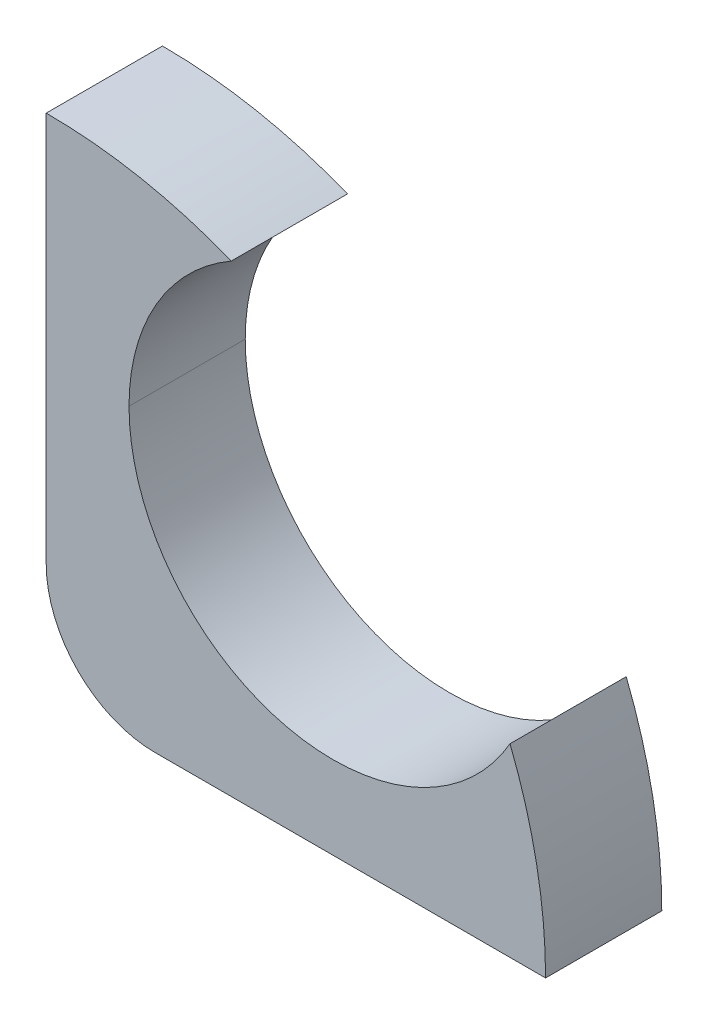
ISO-10303-21;
HEADER;
FILE_DESCRIPTION(('STEP AP214'),'2;1');
FILE_NAME('part.step','',(''),(''),'','','');
FILE_SCHEMA(('AUTOMOTIVE_DESIGN { 1 0 10303 214 1 1 1 1 }'));
ENDSEC;
DATA;
#1=APPLICATION_CONTEXT('core data for automotive mechanical design processes');
#2=APPLICATION_PROTOCOL_DEFINITION('international standard','automotive_design',2000,#1);
#3=PRODUCT_CONTEXT('',#1,'mechanical');
#4=PRODUCT('Part','Part','',(#3));
#5=PRODUCT_RELATED_PRODUCT_CATEGORY('part','',(#4));
#6=PRODUCT_DEFINITION_FORMATION('','',#4);
#7=PRODUCT_DEFINITION_CONTEXT('part definition',#1,'design');
#8=PRODUCT_DEFINITION('design','',#6,#7);
#9=PRODUCT_DEFINITION_SHAPE('','',#8);
#10=(LENGTH_UNIT() NAMED_UNIT(*) SI_UNIT(.MILLI.,.METRE.));
#11=(NAMED_UNIT(*) PLANE_ANGLE_UNIT() SI_UNIT($,.RADIAN.));
#12=(NAMED_UNIT(*) SI_UNIT($,.STERADIAN.) SOLID_ANGLE_UNIT());
#13=UNCERTAINTY_MEASURE_WITH_UNIT(LENGTH_MEASURE(1.E-05),#10,'distance_accuracy_value','');
#14=(GEOMETRIC_REPRESENTATION_CONTEXT(3) GLOBAL_UNCERTAINTY_ASSIGNED_CONTEXT((#13)) GLOBAL_UNIT_ASSIGNED_CONTEXT((#10,
#11,#12)) REPRESENTATION_CONTEXT('',''));
#15=CARTESIAN_POINT('',(0.,0.,0.));
#16=DIRECTION('',(0.,0.,1.));
#17=DIRECTION('',(1.,0.,0.));
#18=AXIS2_PLACEMENT_3D('',#15,#16,#17);
#19=CARTESIAN_POINT('',(-18.45,-18.45,18.95));
#20=DIRECTION('',(0.,0.,1.));
#21=DIRECTION('',(1.,0.,0.));
#22=AXIS2_PLACEMENT_3D('',#19,#20,#21);
#23=PLANE('',#22);
#24=CARTESIAN_POINT('',(-18.45,-18.45,18.95));
#25=DIRECTION('',(0.,0.,1.));
#26=DIRECTION('',(1.,0.,0.));
#27=AXIS2_PLACEMENT_3D('',#24,#25,#26);
#28=CIRCLE('',#27,1.5);
#29=CARTESIAN_POINT('',(-19.95,-18.45,18.95));
#30=VERTEX_POINT('',#29);
#31=CARTESIAN_POINT('',(-18.45,-19.95,18.95));
#32=VERTEX_POINT('',#31);
#33=EDGE_CURVE('E109',#30,#32,#28,.T.);
#34=ORIENTED_EDGE('',*,*,#33,.F.);
#35=DIRECTION('',(0.,-1.,0.));
#36=VECTOR('',#35,1.);
#37=CARTESIAN_POINT('',(-19.95,-13.075,18.95));
#38=LINE('',#37,#36);
#39=CARTESIAN_POINT('',(-19.95,-13.075,18.95));
#40=VERTEX_POINT('',#39);
#41=EDGE_CURVE('E26',#40,#30,#38,.T.);
#42=ORIENTED_EDGE('',*,*,#41,.F.);
#43=CARTESIAN_POINT('',(-19.95,-19.95,18.95));
#44=DIRECTION('',(0.,0.,1.));
#45=DIRECTION('',(1.,0.,0.));
#46=AXIS2_PLACEMENT_3D('',#43,#44,#45);
#47=CIRCLE('',#46,6.875);
#48=CARTESIAN_POINT('',(-17.4018583423997,-13.5646574803851,18.95));
#49=VERTEX_POINT('',#48);
#50=EDGE_CURVE('E147',#49,#40,#47,.T.);
#51=ORIENTED_EDGE('',*,*,#50,.F.);
#52=CARTESIAN_POINT('',(-16.,-16.,18.95));
#53=DIRECTION('',(0.,0.,-1.));
#54=DIRECTION('',(1.,0.,0.));
#55=AXIS2_PLACEMENT_3D('',#52,#53,#54);
#56=CIRCLE('',#55,2.81);
#57=CARTESIAN_POINT('',(-18.81,-16.,18.95));
#58=VERTEX_POINT('',#57);
#59=EDGE_CURVE('E133',#58,#49,#56,.T.);
#60=ORIENTED_EDGE('',*,*,#59,.F.);
#61=CARTESIAN_POINT('',(-16.,-16.,18.95));
#62=DIRECTION('',(0.,0.,-1.));
#63=DIRECTION('',(1.,0.,0.));
#64=AXIS2_PLACEMENT_3D('',#61,#62,#63);
#65=CIRCLE('',#64,2.81);
#66=CARTESIAN_POINT('',(-13.5646574803851,-17.4018583423997,18.95));
#67=VERTEX_POINT('',#66);
#68=EDGE_CURVE('E144',#67,#58,#65,.T.);
#69=ORIENTED_EDGE('',*,*,#68,.F.);
#70=CARTESIAN_POINT('',(-19.95,-19.95,18.95));
#71=DIRECTION('',(0.,0.,1.));
#72=DIRECTION('',(1.,0.,0.));
#73=AXIS2_PLACEMENT_3D('',#70,#71,#72);
#74=CIRCLE('',#73,6.875);
#75=CARTESIAN_POINT('',(-13.075,-19.95,18.95));
#76=VERTEX_POINT('',#75);
#77=EDGE_CURVE('E97',#76,#67,#74,.T.);
#78=ORIENTED_EDGE('',*,*,#77,.F.);
#79=DIRECTION('',(1.,0.,0.));
#80=VECTOR('',#79,1.);
#81=CARTESIAN_POINT('',(-18.45,-19.95,18.95));
#82=LINE('',#81,#80);
#83=EDGE_CURVE('E124',#32,#76,#82,.T.);
#84=ORIENTED_EDGE('',*,*,#83,.F.);
#85=EDGE_LOOP('',(#34,#42,#51,#60,#69,#78,#84));
#86=FACE_BOUND('',#85,.T.);
#87=ADVANCED_FACE('F16',(#86),#23,.F.);
#88=CARTESIAN_POINT('',(-18.45,-18.45,20.55));
#89=DIRECTION('',(0.,0.,1.));
#90=DIRECTION('',(1.,0.,0.));
#91=AXIS2_PLACEMENT_3D('',#88,#89,#90);
#92=PLANE('',#91);
#93=CARTESIAN_POINT('',(-18.45,-18.45,20.55));
#94=DIRECTION('',(0.,0.,1.));
#95=DIRECTION('',(1.,0.,0.));
#96=AXIS2_PLACEMENT_3D('',#93,#94,#95);
#97=CIRCLE('',#96,1.5);
#98=CARTESIAN_POINT('',(-19.95,-18.45,20.55));
#99=VERTEX_POINT('',#98);
#100=CARTESIAN_POINT('',(-18.45,-19.95,20.55));
#101=VERTEX_POINT('',#100);
#102=EDGE_CURVE('E100',#99,#101,#97,.T.);
#103=ORIENTED_EDGE('',*,*,#102,.T.);
#104=DIRECTION('',(1.,0.,0.));
#105=VECTOR('',#104,1.);
#106=CARTESIAN_POINT('',(-18.45,-19.95,20.55));
#107=LINE('',#106,#105);
#108=CARTESIAN_POINT('',(-13.075,-19.95,20.55));
#109=VERTEX_POINT('',#108);
#110=EDGE_CURVE('E85',#101,#109,#107,.T.);
#111=ORIENTED_EDGE('',*,*,#110,.T.);
#112=CARTESIAN_POINT('',(-19.95,-19.95,20.55));
#113=DIRECTION('',(0.,0.,1.));
#114=DIRECTION('',(1.,0.,0.));
#115=AXIS2_PLACEMENT_3D('',#112,#113,#114);
#116=CIRCLE('',#115,6.875);
#117=CARTESIAN_POINT('',(-13.5646574803851,-17.4018583423997,20.55));
#118=VERTEX_POINT('',#117);
#119=EDGE_CURVE('E132',#109,#118,#116,.T.);
#120=ORIENTED_EDGE('',*,*,#119,.T.);
#121=CARTESIAN_POINT('',(-16.,-16.,20.55));
#122=DIRECTION('',(0.,0.,-1.));
#123=DIRECTION('',(1.,0.,0.));
#124=AXIS2_PLACEMENT_3D('',#121,#122,#123);
#125=CIRCLE('',#124,2.81);
#126=CARTESIAN_POINT('',(-18.81,-16.,20.55));
#127=VERTEX_POINT('',#126);
#128=EDGE_CURVE('E140',#118,#127,#125,.T.);
#129=ORIENTED_EDGE('',*,*,#128,.T.);
#130=CARTESIAN_POINT('',(-16.,-16.,20.55));
#131=DIRECTION('',(0.,0.,-1.));
#132=DIRECTION('',(1.,0.,0.));
#133=AXIS2_PLACEMENT_3D('',#130,#131,#132);
#134=CIRCLE('',#133,2.81);
#135=CARTESIAN_POINT('',(-17.4018583423997,-13.5646574803851,20.55));
#136=VERTEX_POINT('',#135);
#137=EDGE_CURVE('E118',#127,#136,#134,.T.);
#138=ORIENTED_EDGE('',*,*,#137,.T.);
#139=CARTESIAN_POINT('',(-19.95,-19.95,20.55));
#140=DIRECTION('',(0.,0.,1.));
#141=DIRECTION('',(1.,0.,0.));
#142=AXIS2_PLACEMENT_3D('',#139,#140,#141);
#143=CIRCLE('',#142,6.875);
#144=CARTESIAN_POINT('',(-19.95,-13.075,20.55));
#145=VERTEX_POINT('',#144);
#146=EDGE_CURVE('E154',#136,#145,#143,.T.);
#147=ORIENTED_EDGE('',*,*,#146,.T.);
#148=DIRECTION('',(0.,-1.,0.));
#149=VECTOR('',#148,1.);
#150=CARTESIAN_POINT('',(-19.95,-13.075,20.55));
#151=LINE('',#150,#149);
#152=EDGE_CURVE('E11',#145,#99,#151,.T.);
#153=ORIENTED_EDGE('',*,*,#152,.T.);
#154=EDGE_LOOP('',(#103,#111,#120,#129,#138,#147,#153));
#155=FACE_BOUND('',#154,.T.);
#156=ADVANCED_FACE('F101',(#155),#92,.T.);
#157=CARTESIAN_POINT('',(-19.95,-13.075,20.55));
#158=DIRECTION('',(1.,0.,0.));
#159=DIRECTION('',(0.,1.,0.));
#160=AXIS2_PLACEMENT_3D('',#157,#158,#159);
#161=PLANE('',#160);
#162=ORIENTED_EDGE('',*,*,#41,.T.);
#163=DIRECTION('',(0.,0.,-1.));
#164=VECTOR('',#163,1.);
#165=CARTESIAN_POINT('',(-19.95,-18.45,20.55));
#166=LINE('',#165,#164);
#167=EDGE_CURVE('E105',#99,#30,#166,.T.);
#168=ORIENTED_EDGE('',*,*,#167,.F.);
#169=ORIENTED_EDGE('',*,*,#152,.F.);
#170=DIRECTION('',(0.,0.,-1.));
#171=VECTOR('',#170,1.);
#172=CARTESIAN_POINT('',(-19.95,-13.075,20.55));
#173=LINE('',#172,#171);
#174=EDGE_CURVE('E151',#145,#40,#173,.T.);
#175=ORIENTED_EDGE('',*,*,#174,.T.);
#176=EDGE_LOOP('',(#162,#168,#169,#175));
#177=FACE_BOUND('',#176,.T.);
#178=ADVANCED_FACE('F174',(#177),#161,.F.);
#179=CARTESIAN_POINT('',(-19.95,-19.95,20.55));
#180=DIRECTION('',(0.,0.,-1.));
#181=DIRECTION('',(-1.,0.,0.));
#182=AXIS2_PLACEMENT_3D('',#179,#180,#181);
#183=CYLINDRICAL_SURFACE('',#182,6.875);
#184=ORIENTED_EDGE('',*,*,#50,.T.);
#185=ORIENTED_EDGE('',*,*,#174,.F.);
#186=ORIENTED_EDGE('',*,*,#146,.F.);
#187=DIRECTION('',(0.,0.,-1.));
#188=VECTOR('',#187,1.);
#189=CARTESIAN_POINT('',(-17.4018583423997,-13.5646574803851,20.55));
#190=LINE('',#189,#188);
#191=EDGE_CURVE('E19',#136,#49,#190,.T.);
#192=ORIENTED_EDGE('',*,*,#191,.T.);
#193=EDGE_LOOP('',(#184,#185,#186,#192));
#194=FACE_BOUND('',#193,.T.);
#195=ADVANCED_FACE('F170',(#194),#183,.T.);
#196=CARTESIAN_POINT('',(-16.,-16.,20.55));
#197=DIRECTION('',(0.,0.,-1.));
#198=DIRECTION('',(-1.,0.,0.));
#199=AXIS2_PLACEMENT_3D('',#196,#197,#198);
#200=CYLINDRICAL_SURFACE('',#199,2.81);
#201=DIRECTION('',(0.,0.,-1.));
#202=VECTOR('',#201,1.);
#203=CARTESIAN_POINT('',(-18.81,-16.,20.55));
#204=LINE('',#203,#202);
#205=EDGE_CURVE('E121',#127,#58,#204,.T.);
#206=ORIENTED_EDGE('',*,*,#205,.F.);
#207=ORIENTED_EDGE('',*,*,#128,.F.);
#208=DIRECTION('',(0.,0.,-1.));
#209=VECTOR('',#208,1.);
#210=CARTESIAN_POINT('',(-13.5646574803851,-17.4018583423997,20.55));
#211=LINE('',#210,#209);
#212=EDGE_CURVE('E128',#118,#67,#211,.T.);
#213=ORIENTED_EDGE('',*,*,#212,.T.);
#214=ORIENTED_EDGE('',*,*,#68,.T.);
#215=EDGE_LOOP('',(#206,#207,#213,#214));
#216=FACE_BOUND('',#215,.T.);
#217=ADVANCED_FACE('F183',(#216),#200,.F.);
#218=CARTESIAN_POINT('',(-19.95,-19.95,20.55));
#219=DIRECTION('',(0.,0.,-1.));
#220=DIRECTION('',(-1.,0.,0.));
#221=AXIS2_PLACEMENT_3D('',#218,#219,#220);
#222=CYLINDRICAL_SURFACE('',#221,6.875);
#223=ORIENTED_EDGE('',*,*,#77,.T.);
#224=ORIENTED_EDGE('',*,*,#212,.F.);
#225=ORIENTED_EDGE('',*,*,#119,.F.);
#226=DIRECTION('',(0.,0.,-1.));
#227=VECTOR('',#226,1.);
#228=CARTESIAN_POINT('',(-13.075,-19.95,20.55));
#229=LINE('',#228,#227);
#230=EDGE_CURVE('E93',#109,#76,#229,.T.);
#231=ORIENTED_EDGE('',*,*,#230,.T.);
#232=EDGE_LOOP('',(#223,#224,#225,#231));
#233=FACE_BOUND('',#232,.T.);
#234=ADVANCED_FACE('F246',(#233),#222,.T.);
#235=CARTESIAN_POINT('',(-18.45,-19.95,20.55));
#236=DIRECTION('',(0.,1.,0.));
#237=DIRECTION('',(1.,0.,0.));
#238=AXIS2_PLACEMENT_3D('',#235,#236,#237);
#239=PLANE('',#238);
#240=ORIENTED_EDGE('',*,*,#83,.T.);
#241=ORIENTED_EDGE('',*,*,#230,.F.);
#242=ORIENTED_EDGE('',*,*,#110,.F.);
#243=DIRECTION('',(0.,0.,-1.));
#244=VECTOR('',#243,1.);
#245=CARTESIAN_POINT('',(-18.45,-19.95,20.55));
#246=LINE('',#245,#244);
#247=EDGE_CURVE('E90',#101,#32,#246,.T.);
#248=ORIENTED_EDGE('',*,*,#247,.T.);
#249=EDGE_LOOP('',(#240,#241,#242,#248));
#250=FACE_BOUND('',#249,.T.);
#251=ADVANCED_FACE('F88',(#250),#239,.F.);
#252=CARTESIAN_POINT('',(-18.45,-18.45,20.55));
#253=DIRECTION('',(0.,0.,-1.));
#254=DIRECTION('',(-1.,0.,0.));
#255=AXIS2_PLACEMENT_3D('',#252,#253,#254);
#256=CYLINDRICAL_SURFACE('',#255,1.5);
#257=ORIENTED_EDGE('',*,*,#33,.T.);
#258=ORIENTED_EDGE('',*,*,#247,.F.);
#259=ORIENTED_EDGE('',*,*,#102,.F.);
#260=ORIENTED_EDGE('',*,*,#167,.T.);
#261=EDGE_LOOP('',(#257,#258,#259,#260));
#262=FACE_BOUND('',#261,.T.);
#263=ADVANCED_FACE('F107',(#262),#256,.T.);
#264=CARTESIAN_POINT('',(-16.,-16.,20.55));
#265=DIRECTION('',(0.,0.,-1.));
#266=DIRECTION('',(-1.,0.,0.));
#267=AXIS2_PLACEMENT_3D('',#264,#265,#266);
#268=CYLINDRICAL_SURFACE('',#267,2.81);
#269=ORIENTED_EDGE('',*,*,#137,.F.);
#270=ORIENTED_EDGE('',*,*,#205,.T.);
#271=ORIENTED_EDGE('',*,*,#59,.T.);
#272=ORIENTED_EDGE('',*,*,#191,.F.);
#273=EDGE_LOOP('',(#269,#270,#271,#272));
#274=FACE_BOUND('',#273,.T.);
#275=ADVANCED_FACE('F226',(#274),#268,.F.);
#276=CLOSED_SHELL('',(#87,#156,#178,#195,#217,#234,#251,#263,#275));
#277=MANIFOLD_SOLID_BREP('B1',#276);
#278=ADVANCED_BREP_SHAPE_REPRESENTATION('',(#18,#277),#14);
#279=SHAPE_DEFINITION_REPRESENTATION(#9,#278);
ENDSEC;
END-ISO-10303-21;
